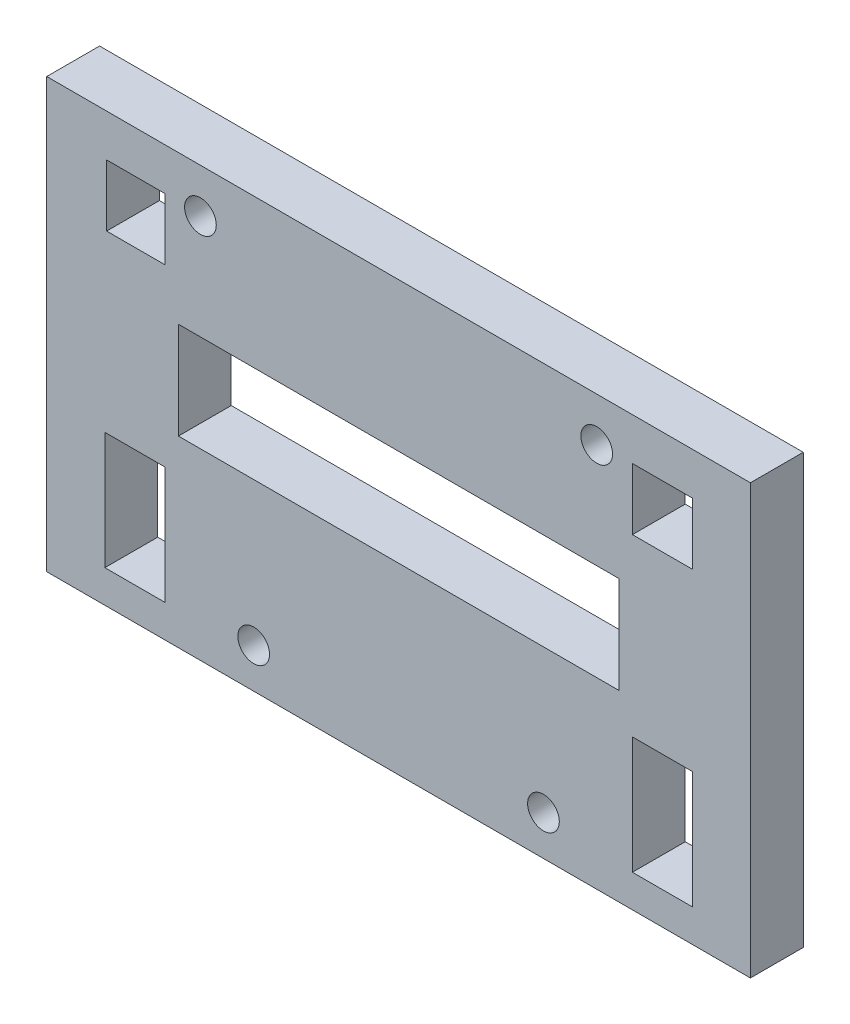
ISO-10303-21;
HEADER;
FILE_DESCRIPTION(('STEP AP214'),'2;1');
FILE_NAME('part.step','',(''),(''),'','','');
FILE_SCHEMA(('AUTOMOTIVE_DESIGN { 1 0 10303 214 1 1 1 1 }'));
ENDSEC;
DATA;
#1=APPLICATION_CONTEXT('core data for automotive mechanical design processes');
#2=APPLICATION_PROTOCOL_DEFINITION('international standard','automotive_design',2000,#1);
#3=PRODUCT_CONTEXT('',#1,'mechanical');
#4=PRODUCT('Part','Part','',(#3));
#5=PRODUCT_RELATED_PRODUCT_CATEGORY('part','',(#4));
#6=PRODUCT_DEFINITION_FORMATION('','',#4);
#7=PRODUCT_DEFINITION_CONTEXT('part definition',#1,'design');
#8=PRODUCT_DEFINITION('design','',#6,#7);
#9=PRODUCT_DEFINITION_SHAPE('','',#8);
#10=(LENGTH_UNIT() NAMED_UNIT(*) SI_UNIT(.MILLI.,.METRE.));
#11=(NAMED_UNIT(*) PLANE_ANGLE_UNIT() SI_UNIT($,.RADIAN.));
#12=(NAMED_UNIT(*) SI_UNIT($,.STERADIAN.) SOLID_ANGLE_UNIT());
#13=UNCERTAINTY_MEASURE_WITH_UNIT(LENGTH_MEASURE(1.E-05),#10,'distance_accuracy_value','');
#14=(GEOMETRIC_REPRESENTATION_CONTEXT(3) GLOBAL_UNCERTAINTY_ASSIGNED_CONTEXT((#13)) GLOBAL_UNIT_ASSIGNED_CONTEXT((#10,
#11,#12)) REPRESENTATION_CONTEXT('',''));
#15=CARTESIAN_POINT('',(0.,0.,0.));
#16=DIRECTION('',(0.,0.,1.));
#17=DIRECTION('',(1.,0.,0.));
#18=AXIS2_PLACEMENT_3D('',#15,#16,#17);
#19=CARTESIAN_POINT('',(0.,0.,6.));
#20=DIRECTION('',(0.,0.,1.));
#21=DIRECTION('',(1.,0.,0.));
#22=AXIS2_PLACEMENT_3D('',#19,#20,#21);
#23=PLANE('',#22);
#24=CARTESIAN_POINT('',(86.7166078075554,11.7571425144816,6.));
#25=DIRECTION('',(0.,0.,1.));
#26=DIRECTION('',(1.,0.,0.));
#27=AXIS2_PLACEMENT_3D('',#24,#25,#26);
#28=CIRCLE('',#27,1.8);
#29=CARTESIAN_POINT('',(88.5166078075554,11.7571425144816,6.));
#30=VERTEX_POINT('',#29);
#31=EDGE_CURVE('E365',#30,#30,#28,.T.);
#32=ORIENTED_EDGE('',*,*,#31,.F.);
#33=EDGE_LOOP('',(#32));
#34=FACE_BOUND('',#33,.T.);
#35=CARTESIAN_POINT('',(53.816607807554,11.7571425144822,6.));
#36=DIRECTION('',(0.,0.,1.));
#37=DIRECTION('',(1.,0.,0.));
#38=AXIS2_PLACEMENT_3D('',#35,#36,#37);
#39=CIRCLE('',#38,1.79999999999991);
#40=CARTESIAN_POINT('',(55.6166078075539,11.7571425144822,6.));
#41=VERTEX_POINT('',#40);
#42=EDGE_CURVE('E377',#41,#41,#39,.T.);
#43=ORIENTED_EDGE('',*,*,#42,.F.);
#44=EDGE_LOOP('',(#43));
#45=FACE_BOUND('',#44,.T.);
#46=DIRECTION('',(0.,-1.,0.));
#47=VECTOR('',#46,1.);
#48=CARTESIAN_POINT('',(30.3166078075552,55.9396789256046,6.));
#49=LINE('',#48,#47);
#50=CARTESIAN_POINT('',(30.3166078075552,55.9396789256046,6.));
#51=VERTEX_POINT('',#50);
#52=CARTESIAN_POINT('',(30.3166078075552,7.24140904448546,6.));
#53=VERTEX_POINT('',#52);
#54=EDGE_CURVE('E383',#51,#53,#49,.T.);
#55=ORIENTED_EDGE('',*,*,#54,.T.);
#56=DIRECTION('',(1.,0.,0.));
#57=VECTOR('',#56,1.);
#58=CARTESIAN_POINT('',(30.3166078075552,7.24140904448546,6.));
#59=LINE('',#58,#57);
#60=CARTESIAN_POINT('',(110.216607807554,7.24140904448489,6.));
#61=VERTEX_POINT('',#60);
#62=EDGE_CURVE('E386',#53,#61,#59,.T.);
#63=ORIENTED_EDGE('',*,*,#62,.T.);
#64=DIRECTION('',(0.,1.,0.));
#65=VECTOR('',#64,1.);
#66=CARTESIAN_POINT('',(110.216607807554,7.24140904448489,6.));
#67=LINE('',#66,#65);
#68=CARTESIAN_POINT('',(110.216607807555,55.9396789256044,6.));
#69=VERTEX_POINT('',#68);
#70=EDGE_CURVE('E389',#61,#69,#67,.T.);
#71=ORIENTED_EDGE('',*,*,#70,.T.);
#72=DIRECTION('',(-1.,0.,0.));
#73=VECTOR('',#72,1.);
#74=CARTESIAN_POINT('',(110.216607807555,55.9396789256044,6.));
#75=LINE('',#74,#73);
#76=EDGE_CURVE('E391',#69,#51,#75,.T.);
#77=ORIENTED_EDGE('',*,*,#76,.T.);
#78=EDGE_LOOP('',(#55,#63,#71,#77));
#79=FACE_BOUND('',#78,.T.);
#80=CARTESIAN_POINT('',(92.7666078075557,50.9396789256046,6.));
#81=DIRECTION('',(0.,0.,1.));
#82=DIRECTION('',(1.,0.,0.));
#83=AXIS2_PLACEMENT_3D('',#80,#81,#82);
#84=CIRCLE('',#83,1.8);
#85=CARTESIAN_POINT('',(94.5666078075557,50.9396789256046,6.));
#86=VERTEX_POINT('',#85);
#87=EDGE_CURVE('E371',#86,#86,#84,.T.);
#88=ORIENTED_EDGE('',*,*,#87,.F.);
#89=EDGE_LOOP('',(#88));
#90=FACE_BOUND('',#89,.T.);
#91=CARTESIAN_POINT('',(47.7666078075558,50.9396789256045,6.));
#92=DIRECTION('',(0.,0.,1.));
#93=DIRECTION('',(1.,0.,0.));
#94=AXIS2_PLACEMENT_3D('',#91,#92,#93);
#95=CIRCLE('',#94,1.8);
#96=CARTESIAN_POINT('',(49.5666078075558,50.9396789256045,6.));
#97=VERTEX_POINT('',#96);
#98=EDGE_CURVE('E359',#97,#97,#95,.T.);
#99=ORIENTED_EDGE('',*,*,#98,.F.);
#100=EDGE_LOOP('',(#99));
#101=FACE_BOUND('',#100,.T.);
#102=DIRECTION('',(-1.,0.,0.));
#103=VECTOR('',#102,1.);
#104=CARTESIAN_POINT('',(36.9166078075555,24.2519543495992,6.));
#105=LINE('',#104,#103);
#106=CARTESIAN_POINT('',(43.7166078075556,24.2519543495992,6.));
#107=VERTEX_POINT('',#106);
#108=CARTESIAN_POINT('',(36.9166078075555,24.2519543495992,6.));
#109=VERTEX_POINT('',#108);
#110=EDGE_CURVE('E330',#107,#109,#105,.T.);
#111=ORIENTED_EDGE('',*,*,#110,.F.);
#112=DIRECTION('',(0.,1.,0.));
#113=VECTOR('',#112,1.);
#114=CARTESIAN_POINT('',(43.7166078075556,24.2519543495992,6.));
#115=LINE('',#114,#113);
#116=CARTESIAN_POINT('',(43.7166078075556,10.939678925605,6.));
#117=VERTEX_POINT('',#116);
#118=EDGE_CURVE('E328',#117,#107,#115,.T.);
#119=ORIENTED_EDGE('',*,*,#118,.F.);
#120=DIRECTION('',(1.,0.,0.));
#121=VECTOR('',#120,1.);
#122=CARTESIAN_POINT('',(43.7166078075556,10.939678925605,6.));
#123=LINE('',#122,#121);
#124=CARTESIAN_POINT('',(36.9166078075554,10.9396789256052,6.));
#125=VERTEX_POINT('',#124);
#126=EDGE_CURVE('E336',#125,#117,#123,.T.);
#127=ORIENTED_EDGE('',*,*,#126,.F.);
#128=DIRECTION('',(0.,-1.,0.));
#129=VECTOR('',#128,1.);
#130=CARTESIAN_POINT('',(36.9166078075554,10.9396789256052,6.));
#131=LINE('',#130,#129);
#132=EDGE_CURVE('E333',#109,#125,#131,.T.);
#133=ORIENTED_EDGE('',*,*,#132,.F.);
#134=EDGE_LOOP('',(#111,#119,#127,#133));
#135=FACE_BOUND('',#134,.T.);
#136=DIRECTION('',(0.,1.,0.));
#137=VECTOR('',#136,1.);
#138=CARTESIAN_POINT('',(43.7166078075559,51.1396789256042,6.));
#139=LINE('',#138,#137);
#140=CARTESIAN_POINT('',(43.7166078075556,44.1396789256045,6.));
#141=VERTEX_POINT('',#140);
#142=CARTESIAN_POINT('',(43.7166078075559,51.1396789256042,6.));
#143=VERTEX_POINT('',#142);
#144=EDGE_CURVE('E299',#141,#143,#139,.T.);
#145=ORIENTED_EDGE('',*,*,#144,.F.);
#146=DIRECTION('',(1.,0.,0.));
#147=VECTOR('',#146,1.);
#148=CARTESIAN_POINT('',(43.7166078075556,44.1396789256045,6.));
#149=LINE('',#148,#147);
#150=CARTESIAN_POINT('',(37.116607807556,44.1396789256043,6.));
#151=VERTEX_POINT('',#150);
#152=EDGE_CURVE('E297',#151,#141,#149,.T.);
#153=ORIENTED_EDGE('',*,*,#152,.F.);
#154=DIRECTION('',(0.,-1.,0.));
#155=VECTOR('',#154,1.);
#156=CARTESIAN_POINT('',(37.116607807556,44.1396789256043,6.));
#157=LINE('',#156,#155);
#158=CARTESIAN_POINT('',(37.1166078075556,51.1396789256044,6.));
#159=VERTEX_POINT('',#158);
#160=EDGE_CURVE('E305',#159,#151,#157,.T.);
#161=ORIENTED_EDGE('',*,*,#160,.F.);
#162=DIRECTION('',(-1.,0.,0.));
#163=VECTOR('',#162,1.);
#164=CARTESIAN_POINT('',(37.1166078075556,51.1396789256044,6.));
#165=LINE('',#164,#163);
#166=EDGE_CURVE('E302',#143,#159,#165,.T.);
#167=ORIENTED_EDGE('',*,*,#166,.F.);
#168=EDGE_LOOP('',(#145,#153,#161,#167));
#169=FACE_BOUND('',#168,.T.);
#170=DIRECTION('',(1.,0.,0.));
#171=VECTOR('',#170,1.);
#172=CARTESIAN_POINT('',(96.8166078075556,10.9396789256048,6.));
#173=LINE('',#172,#171);
#174=CARTESIAN_POINT('',(96.8166078075556,10.9396789256048,6.));
#175=VERTEX_POINT('',#174);
#176=CARTESIAN_POINT('',(103.616607807555,10.939678925605,6.));
#177=VERTEX_POINT('',#176);
#178=EDGE_CURVE('E268',#175,#177,#173,.T.);
#179=ORIENTED_EDGE('',*,*,#178,.F.);
#180=DIRECTION('',(0.,-1.,0.));
#181=VECTOR('',#180,1.);
#182=CARTESIAN_POINT('',(96.8166078075552,24.2519543495986,6.));
#183=LINE('',#182,#181);
#184=CARTESIAN_POINT('',(96.8166078075552,24.2519543495986,6.));
#185=VERTEX_POINT('',#184);
#186=EDGE_CURVE('E266',#185,#175,#183,.T.);
#187=ORIENTED_EDGE('',*,*,#186,.F.);
#188=DIRECTION('',(-1.,0.,0.));
#189=VECTOR('',#188,1.);
#190=CARTESIAN_POINT('',(103.616607807555,24.2519543495984,6.));
#191=LINE('',#190,#189);
#192=CARTESIAN_POINT('',(103.616607807555,24.2519543495984,6.));
#193=VERTEX_POINT('',#192);
#194=EDGE_CURVE('E274',#193,#185,#191,.T.);
#195=ORIENTED_EDGE('',*,*,#194,.F.);
#196=DIRECTION('',(0.,1.,0.));
#197=VECTOR('',#196,1.);
#198=CARTESIAN_POINT('',(103.616607807555,10.939678925605,6.));
#199=LINE('',#198,#197);
#200=EDGE_CURVE('E271',#177,#193,#199,.T.);
#201=ORIENTED_EDGE('',*,*,#200,.F.);
#202=EDGE_LOOP('',(#179,#187,#195,#201));
#203=FACE_BOUND('',#202,.T.);
#204=DIRECTION('',(1.,0.,0.));
#205=VECTOR('',#204,1.);
#206=CARTESIAN_POINT('',(96.8166078075559,44.1396789256042,6.));
#207=LINE('',#206,#205);
#208=CARTESIAN_POINT('',(96.8166078075559,44.1396789256042,6.));
#209=VERTEX_POINT('',#208);
#210=CARTESIAN_POINT('',(103.616607807555,44.1396789256045,6.));
#211=VERTEX_POINT('',#210);
#212=EDGE_CURVE('E237',#209,#211,#207,.T.);
#213=ORIENTED_EDGE('',*,*,#212,.F.);
#214=DIRECTION('',(0.,-1.,0.));
#215=VECTOR('',#214,1.);
#216=CARTESIAN_POINT('',(96.8166078075559,51.1396789256043,6.));
#217=LINE('',#216,#215);
#218=CARTESIAN_POINT('',(96.8166078075559,51.1396789256043,6.));
#219=VERTEX_POINT('',#218);
#220=EDGE_CURVE('E235',#219,#209,#217,.T.);
#221=ORIENTED_EDGE('',*,*,#220,.F.);
#222=DIRECTION('',(-1.,0.,0.));
#223=VECTOR('',#222,1.);
#224=CARTESIAN_POINT('',(103.616607807555,51.1396789256045,6.));
#225=LINE('',#224,#223);
#226=CARTESIAN_POINT('',(103.616607807555,51.1396789256045,6.));
#227=VERTEX_POINT('',#226);
#228=EDGE_CURVE('E243',#227,#219,#225,.T.);
#229=ORIENTED_EDGE('',*,*,#228,.F.);
#230=DIRECTION('',(0.,1.,0.));
#231=VECTOR('',#230,1.);
#232=CARTESIAN_POINT('',(103.616607807555,44.1396789256045,6.));
#233=LINE('',#232,#231);
#234=EDGE_CURVE('E240',#211,#227,#233,.T.);
#235=ORIENTED_EDGE('',*,*,#234,.F.);
#236=EDGE_LOOP('',(#213,#221,#229,#235));
#237=FACE_BOUND('',#236,.T.);
#238=DIRECTION('',(0.,-1.,0.));
#239=VECTOR('',#238,1.);
#240=CARTESIAN_POINT('',(45.2666179586975,39.0571400164249,6.));
#241=LINE('',#240,#239);
#242=CARTESIAN_POINT('',(45.2666179586975,39.0571400164249,6.));
#243=VERTEX_POINT('',#242);
#244=CARTESIAN_POINT('',(45.266617958698,28.057145012539,6.));
#245=VERTEX_POINT('',#244);
#246=EDGE_CURVE('E207',#243,#245,#241,.T.);
#247=ORIENTED_EDGE('',*,*,#246,.F.);
#248=DIRECTION('',(-1.,0.,0.));
#249=VECTOR('',#248,1.);
#250=CARTESIAN_POINT('',(95.2665976564134,39.0571400164242,6.));
#251=LINE('',#250,#249);
#252=CARTESIAN_POINT('',(95.2665976564134,39.0571400164242,6.));
#253=VERTEX_POINT('',#252);
#254=EDGE_CURVE('E199',#253,#243,#251,.T.);
#255=ORIENTED_EDGE('',*,*,#254,.F.);
#256=DIRECTION('',(0.,1.,0.));
#257=VECTOR('',#256,1.);
#258=CARTESIAN_POINT('',(95.2665976564134,28.0571450125389,6.));
#259=LINE('',#258,#257);
#260=CARTESIAN_POINT('',(95.2665976564134,28.0571450125389,6.));
#261=VERTEX_POINT('',#260);
#262=EDGE_CURVE('E221',#261,#253,#259,.T.);
#263=ORIENTED_EDGE('',*,*,#262,.F.);
#264=DIRECTION('',(1.,0.,0.));
#265=VECTOR('',#264,1.);
#266=CARTESIAN_POINT('',(45.266617958698,28.057145012539,6.));
#267=LINE('',#266,#265);
#268=EDGE_CURVE('E219',#245,#261,#267,.T.);
#269=ORIENTED_EDGE('',*,*,#268,.F.);
#270=EDGE_LOOP('',(#247,#255,#263,#269));
#271=FACE_BOUND('',#270,.T.);
#272=ADVANCED_FACE('F38',(#34,#45,#79,#90,#101,#135,#169,#203,#237,#271),#23,.T.);
#273=CARTESIAN_POINT('',(0.,0.,0.));
#274=DIRECTION('',(0.,0.,1.));
#275=DIRECTION('',(1.,0.,0.));
#276=AXIS2_PLACEMENT_3D('',#273,#274,#275);
#277=PLANE('',#276);
#278=DIRECTION('',(0.,-1.,0.));
#279=VECTOR('',#278,1.);
#280=CARTESIAN_POINT('',(96.8166078075559,51.1396789256043,0.));
#281=LINE('',#280,#279);
#282=CARTESIAN_POINT('',(96.8166078075559,51.1396789256043,0.));
#283=VERTEX_POINT('',#282);
#284=CARTESIAN_POINT('',(96.8166078075559,44.1396789256042,0.));
#285=VERTEX_POINT('',#284);
#286=EDGE_CURVE('E215',#283,#285,#281,.T.);
#287=ORIENTED_EDGE('',*,*,#286,.T.);
#288=DIRECTION('',(1.,0.,0.));
#289=VECTOR('',#288,1.);
#290=CARTESIAN_POINT('',(96.8166078075559,44.1396789256042,0.));
#291=LINE('',#290,#289);
#292=CARTESIAN_POINT('',(103.616607807555,44.1396789256045,0.));
#293=VERTEX_POINT('',#292);
#294=EDGE_CURVE('E248',#285,#293,#291,.T.);
#295=ORIENTED_EDGE('',*,*,#294,.T.);
#296=DIRECTION('',(0.,1.,0.));
#297=VECTOR('',#296,1.);
#298=CARTESIAN_POINT('',(103.616607807555,44.1396789256045,0.));
#299=LINE('',#298,#297);
#300=CARTESIAN_POINT('',(103.616607807555,51.1396789256045,0.));
#301=VERTEX_POINT('',#300);
#302=EDGE_CURVE('E251',#293,#301,#299,.T.);
#303=ORIENTED_EDGE('',*,*,#302,.T.);
#304=DIRECTION('',(-1.,0.,0.));
#305=VECTOR('',#304,1.);
#306=CARTESIAN_POINT('',(103.616607807555,51.1396789256045,0.));
#307=LINE('',#306,#305);
#308=EDGE_CURVE('E238',#301,#283,#307,.T.);
#309=ORIENTED_EDGE('',*,*,#308,.T.);
#310=EDGE_LOOP('',(#287,#295,#303,#309));
#311=FACE_BOUND('',#310,.T.);
#312=DIRECTION('',(1.,0.,0.));
#313=VECTOR('',#312,1.);
#314=CARTESIAN_POINT('',(43.7166078075556,44.1396789256045,0.));
#315=LINE('',#314,#313);
#316=CARTESIAN_POINT('',(37.116607807556,44.1396789256043,0.));
#317=VERTEX_POINT('',#316);
#318=CARTESIAN_POINT('',(43.7166078075556,44.1396789256045,0.));
#319=VERTEX_POINT('',#318);
#320=EDGE_CURVE('E296',#317,#319,#315,.T.);
#321=ORIENTED_EDGE('',*,*,#320,.T.);
#322=DIRECTION('',(0.,1.,0.));
#323=VECTOR('',#322,1.);
#324=CARTESIAN_POINT('',(43.7166078075559,51.1396789256042,0.));
#325=LINE('',#324,#323);
#326=CARTESIAN_POINT('',(43.7166078075559,51.1396789256042,0.));
#327=VERTEX_POINT('',#326);
#328=EDGE_CURVE('E310',#319,#327,#325,.T.);
#329=ORIENTED_EDGE('',*,*,#328,.T.);
#330=DIRECTION('',(-1.,0.,0.));
#331=VECTOR('',#330,1.);
#332=CARTESIAN_POINT('',(37.1166078075556,51.1396789256044,0.));
#333=LINE('',#332,#331);
#334=CARTESIAN_POINT('',(37.1166078075556,51.1396789256044,0.));
#335=VERTEX_POINT('',#334);
#336=EDGE_CURVE('E313',#327,#335,#333,.T.);
#337=ORIENTED_EDGE('',*,*,#336,.T.);
#338=DIRECTION('',(0.,-1.,0.));
#339=VECTOR('',#338,1.);
#340=CARTESIAN_POINT('',(37.116607807556,44.1396789256043,0.));
#341=LINE('',#340,#339);
#342=EDGE_CURVE('E300',#335,#317,#341,.T.);
#343=ORIENTED_EDGE('',*,*,#342,.T.);
#344=EDGE_LOOP('',(#321,#329,#337,#343));
#345=FACE_BOUND('',#344,.T.);
#346=CARTESIAN_POINT('',(47.7666078075558,50.9396789256045,0.));
#347=DIRECTION('',(0.,0.,1.));
#348=DIRECTION('',(1.,0.,0.));
#349=AXIS2_PLACEMENT_3D('',#346,#347,#348);
#350=CIRCLE('',#349,1.8);
#351=CARTESIAN_POINT('',(49.5666078075558,50.9396789256045,0.));
#352=VERTEX_POINT('',#351);
#353=EDGE_CURVE('E358',#352,#352,#350,.T.);
#354=ORIENTED_EDGE('',*,*,#353,.T.);
#355=EDGE_LOOP('',(#354));
#356=FACE_BOUND('',#355,.T.);
#357=CARTESIAN_POINT('',(86.7166078075554,11.7571425144816,0.));
#358=DIRECTION('',(0.,0.,1.));
#359=DIRECTION('',(1.,0.,0.));
#360=AXIS2_PLACEMENT_3D('',#357,#358,#359);
#361=CIRCLE('',#360,1.8);
#362=CARTESIAN_POINT('',(88.5166078075554,11.7571425144816,0.));
#363=VERTEX_POINT('',#362);
#364=EDGE_CURVE('E362',#363,#363,#361,.T.);
#365=ORIENTED_EDGE('',*,*,#364,.T.);
#366=EDGE_LOOP('',(#365));
#367=FACE_BOUND('',#366,.T.);
#368=CARTESIAN_POINT('',(92.7666078075557,50.9396789256046,0.));
#369=DIRECTION('',(0.,0.,1.));
#370=DIRECTION('',(1.,0.,0.));
#371=AXIS2_PLACEMENT_3D('',#368,#369,#370);
#372=CIRCLE('',#371,1.8);
#373=CARTESIAN_POINT('',(94.5666078075557,50.9396789256046,0.));
#374=VERTEX_POINT('',#373);
#375=EDGE_CURVE('E368',#374,#374,#372,.T.);
#376=ORIENTED_EDGE('',*,*,#375,.T.);
#377=EDGE_LOOP('',(#376));
#378=FACE_BOUND('',#377,.T.);
#379=CARTESIAN_POINT('',(53.816607807554,11.7571425144822,0.));
#380=DIRECTION('',(0.,0.,1.));
#381=DIRECTION('',(1.,0.,0.));
#382=AXIS2_PLACEMENT_3D('',#379,#380,#381);
#383=CIRCLE('',#382,1.79999999999991);
#384=CARTESIAN_POINT('',(55.6166078075539,11.7571425144822,0.));
#385=VERTEX_POINT('',#384);
#386=EDGE_CURVE('E374',#385,#385,#383,.T.);
#387=ORIENTED_EDGE('',*,*,#386,.T.);
#388=EDGE_LOOP('',(#387));
#389=FACE_BOUND('',#388,.T.);
#390=DIRECTION('',(0.,-1.,0.));
#391=VECTOR('',#390,1.);
#392=CARTESIAN_POINT('',(30.3166078075552,55.9396789256046,0.));
#393=LINE('',#392,#391);
#394=CARTESIAN_POINT('',(30.3166078075552,55.9396789256046,0.));
#395=VERTEX_POINT('',#394);
#396=CARTESIAN_POINT('',(30.3166078075552,7.24140904448546,0.));
#397=VERTEX_POINT('',#396);
#398=EDGE_CURVE('E380',#395,#397,#393,.T.);
#399=ORIENTED_EDGE('',*,*,#398,.F.);
#400=DIRECTION('',(-1.,0.,0.));
#401=VECTOR('',#400,1.);
#402=CARTESIAN_POINT('',(110.216607807555,55.9396789256044,0.));
#403=LINE('',#402,#401);
#404=CARTESIAN_POINT('',(110.216607807555,55.9396789256044,0.));
#405=VERTEX_POINT('',#404);
#406=EDGE_CURVE('E387',#405,#395,#403,.T.);
#407=ORIENTED_EDGE('',*,*,#406,.F.);
#408=DIRECTION('',(0.,1.,0.));
#409=VECTOR('',#408,1.);
#410=CARTESIAN_POINT('',(110.216607807554,7.24140904448489,0.));
#411=LINE('',#410,#409);
#412=CARTESIAN_POINT('',(110.216607807554,7.24140904448489,0.));
#413=VERTEX_POINT('',#412);
#414=EDGE_CURVE('E398',#413,#405,#411,.T.);
#415=ORIENTED_EDGE('',*,*,#414,.F.);
#416=DIRECTION('',(1.,0.,0.));
#417=VECTOR('',#416,1.);
#418=CARTESIAN_POINT('',(30.3166078075552,7.24140904448546,0.));
#419=LINE('',#418,#417);
#420=EDGE_CURVE('E396',#397,#413,#419,.T.);
#421=ORIENTED_EDGE('',*,*,#420,.F.);
#422=EDGE_LOOP('',(#399,#407,#415,#421));
#423=FACE_BOUND('',#422,.T.);
#424=DIRECTION('',(0.,1.,0.));
#425=VECTOR('',#424,1.);
#426=CARTESIAN_POINT('',(43.7166078075556,24.2519543495992,0.));
#427=LINE('',#426,#425);
#428=CARTESIAN_POINT('',(43.7166078075556,10.939678925605,0.));
#429=VERTEX_POINT('',#428);
#430=CARTESIAN_POINT('',(43.7166078075556,24.2519543495992,0.));
#431=VERTEX_POINT('',#430);
#432=EDGE_CURVE('E327',#429,#431,#427,.T.);
#433=ORIENTED_EDGE('',*,*,#432,.T.);
#434=DIRECTION('',(-1.,0.,0.));
#435=VECTOR('',#434,1.);
#436=CARTESIAN_POINT('',(36.9166078075555,24.2519543495992,0.));
#437=LINE('',#436,#435);
#438=CARTESIAN_POINT('',(36.9166078075555,24.2519543495992,0.));
#439=VERTEX_POINT('',#438);
#440=EDGE_CURVE('E341',#431,#439,#437,.T.);
#441=ORIENTED_EDGE('',*,*,#440,.T.);
#442=DIRECTION('',(0.,-1.,0.));
#443=VECTOR('',#442,1.);
#444=CARTESIAN_POINT('',(36.9166078075554,10.9396789256052,0.));
#445=LINE('',#444,#443);
#446=CARTESIAN_POINT('',(36.9166078075554,10.9396789256052,0.));
#447=VERTEX_POINT('',#446);
#448=EDGE_CURVE('E344',#439,#447,#445,.T.);
#449=ORIENTED_EDGE('',*,*,#448,.T.);
#450=DIRECTION('',(1.,0.,0.));
#451=VECTOR('',#450,1.);
#452=CARTESIAN_POINT('',(43.7166078075556,10.939678925605,0.));
#453=LINE('',#452,#451);
#454=EDGE_CURVE('E331',#447,#429,#453,.T.);
#455=ORIENTED_EDGE('',*,*,#454,.T.);
#456=EDGE_LOOP('',(#433,#441,#449,#455));
#457=FACE_BOUND('',#456,.T.);
#458=DIRECTION('',(0.,-1.,0.));
#459=VECTOR('',#458,1.);
#460=CARTESIAN_POINT('',(96.8166078075552,24.2519543495986,0.));
#461=LINE('',#460,#459);
#462=CARTESIAN_POINT('',(96.8166078075552,24.2519543495986,0.));
#463=VERTEX_POINT('',#462);
#464=CARTESIAN_POINT('',(96.8166078075556,10.9396789256048,0.));
#465=VERTEX_POINT('',#464);
#466=EDGE_CURVE('E265',#463,#465,#461,.T.);
#467=ORIENTED_EDGE('',*,*,#466,.T.);
#468=DIRECTION('',(1.,0.,0.));
#469=VECTOR('',#468,1.);
#470=CARTESIAN_POINT('',(96.8166078075556,10.9396789256048,0.));
#471=LINE('',#470,#469);
#472=CARTESIAN_POINT('',(103.616607807555,10.939678925605,0.));
#473=VERTEX_POINT('',#472);
#474=EDGE_CURVE('E279',#465,#473,#471,.T.);
#475=ORIENTED_EDGE('',*,*,#474,.T.);
#476=DIRECTION('',(0.,1.,0.));
#477=VECTOR('',#476,1.);
#478=CARTESIAN_POINT('',(103.616607807555,10.939678925605,0.));
#479=LINE('',#478,#477);
#480=CARTESIAN_POINT('',(103.616607807555,24.2519543495984,0.));
#481=VERTEX_POINT('',#480);
#482=EDGE_CURVE('E282',#473,#481,#479,.T.);
#483=ORIENTED_EDGE('',*,*,#482,.T.);
#484=DIRECTION('',(-1.,0.,0.));
#485=VECTOR('',#484,1.);
#486=CARTESIAN_POINT('',(103.616607807555,24.2519543495984,0.));
#487=LINE('',#486,#485);
#488=EDGE_CURVE('E269',#481,#463,#487,.T.);
#489=ORIENTED_EDGE('',*,*,#488,.T.);
#490=EDGE_LOOP('',(#467,#475,#483,#489));
#491=FACE_BOUND('',#490,.T.);
#492=DIRECTION('',(-1.,0.,0.));
#493=VECTOR('',#492,1.);
#494=CARTESIAN_POINT('',(95.2665976564134,39.0571400164242,0.));
#495=LINE('',#494,#493);
#496=CARTESIAN_POINT('',(95.2665976564134,39.0571400164242,0.));
#497=VERTEX_POINT('',#496);
#498=CARTESIAN_POINT('',(45.2666179586975,39.0571400164249,0.));
#499=VERTEX_POINT('',#498);
#500=EDGE_CURVE('E61',#497,#499,#495,.T.);
#501=ORIENTED_EDGE('',*,*,#500,.T.);
#502=DIRECTION('',(0.,-1.,0.));
#503=VECTOR('',#502,1.);
#504=CARTESIAN_POINT('',(45.2666179586975,39.0571400164249,0.));
#505=LINE('',#504,#503);
#506=CARTESIAN_POINT('',(45.266617958698,28.057145012539,0.));
#507=VERTEX_POINT('',#506);
#508=EDGE_CURVE('E214',#499,#507,#505,.T.);
#509=ORIENTED_EDGE('',*,*,#508,.T.);
#510=DIRECTION('',(1.,0.,0.));
#511=VECTOR('',#510,1.);
#512=CARTESIAN_POINT('',(45.266617958698,28.057145012539,0.));
#513=LINE('',#512,#511);
#514=CARTESIAN_POINT('',(95.2665976564134,28.0571450125389,0.));
#515=VERTEX_POINT('',#514);
#516=EDGE_CURVE('E227',#507,#515,#513,.T.);
#517=ORIENTED_EDGE('',*,*,#516,.T.);
#518=DIRECTION('',(0.,1.,0.));
#519=VECTOR('',#518,1.);
#520=CARTESIAN_POINT('',(95.2665976564134,28.0571450125389,0.));
#521=LINE('',#520,#519);
#522=EDGE_CURVE('E208',#515,#497,#521,.T.);
#523=ORIENTED_EDGE('',*,*,#522,.T.);
#524=EDGE_LOOP('',(#501,#509,#517,#523));
#525=FACE_BOUND('',#524,.T.);
#526=ADVANCED_FACE('F416',(#311,#345,#356,#367,#378,#389,#423,#457,#491,#525),#277,.F.);
#527=CARTESIAN_POINT('',(30.3166078075552,55.9396789256046,6.));
#528=DIRECTION('',(1.,0.,0.));
#529=DIRECTION('',(0.,0.,-1.));
#530=AXIS2_PLACEMENT_3D('',#527,#528,#529);
#531=PLANE('',#530);
#532=ORIENTED_EDGE('',*,*,#398,.T.);
#533=DIRECTION('',(0.,0.,-1.));
#534=VECTOR('',#533,1.);
#535=CARTESIAN_POINT('',(30.3166078075552,7.24140904448546,6.));
#536=LINE('',#535,#534);
#537=EDGE_CURVE('E11',#53,#397,#536,.T.);
#538=ORIENTED_EDGE('',*,*,#537,.F.);
#539=ORIENTED_EDGE('',*,*,#54,.F.);
#540=DIRECTION('',(0.,0.,-1.));
#541=VECTOR('',#540,1.);
#542=CARTESIAN_POINT('',(30.3166078075552,55.9396789256046,6.));
#543=LINE('',#542,#541);
#544=EDGE_CURVE('E393',#51,#395,#543,.T.);
#545=ORIENTED_EDGE('',*,*,#544,.T.);
#546=EDGE_LOOP('',(#532,#538,#539,#545));
#547=FACE_BOUND('',#546,.T.);
#548=ADVANCED_FACE('F40',(#547),#531,.F.);
#549=CARTESIAN_POINT('',(30.3166078075552,7.24140904448546,6.));
#550=DIRECTION('',(0.,1.,0.));
#551=DIRECTION('',(-1.,0.,0.));
#552=AXIS2_PLACEMENT_3D('',#549,#550,#551);
#553=PLANE('',#552);
#554=ORIENTED_EDGE('',*,*,#420,.T.);
#555=DIRECTION('',(0.,0.,-1.));
#556=VECTOR('',#555,1.);
#557=CARTESIAN_POINT('',(110.216607807554,7.24140904448489,6.));
#558=LINE('',#557,#556);
#559=EDGE_CURVE('E46',#61,#413,#558,.T.);
#560=ORIENTED_EDGE('',*,*,#559,.F.);
#561=ORIENTED_EDGE('',*,*,#62,.F.);
#562=ORIENTED_EDGE('',*,*,#537,.T.);
#563=EDGE_LOOP('',(#554,#560,#561,#562));
#564=FACE_BOUND('',#563,.T.);
#565=ADVANCED_FACE('F427',(#564),#553,.F.);
#566=CARTESIAN_POINT('',(110.216607807554,7.24140904448489,6.));
#567=DIRECTION('',(-1.,0.,0.));
#568=DIRECTION('',(0.,-1.,0.));
#569=AXIS2_PLACEMENT_3D('',#566,#567,#568);
#570=PLANE('',#569);
#571=ORIENTED_EDGE('',*,*,#414,.T.);
#572=DIRECTION('',(0.,0.,-1.));
#573=VECTOR('',#572,1.);
#574=CARTESIAN_POINT('',(110.216607807555,55.9396789256044,6.));
#575=LINE('',#574,#573);
#576=EDGE_CURVE('E403',#69,#405,#575,.T.);
#577=ORIENTED_EDGE('',*,*,#576,.F.);
#578=ORIENTED_EDGE('',*,*,#70,.F.);
#579=ORIENTED_EDGE('',*,*,#559,.T.);
#580=EDGE_LOOP('',(#571,#577,#578,#579));
#581=FACE_BOUND('',#580,.T.);
#582=ADVANCED_FACE('F410',(#581),#570,.F.);
#583=CARTESIAN_POINT('',(110.216607807555,55.9396789256044,6.));
#584=DIRECTION('',(0.,-1.,0.));
#585=DIRECTION('',(1.,0.,0.));
#586=AXIS2_PLACEMENT_3D('',#583,#584,#585);
#587=PLANE('',#586);
#588=ORIENTED_EDGE('',*,*,#406,.T.);
#589=ORIENTED_EDGE('',*,*,#544,.F.);
#590=ORIENTED_EDGE('',*,*,#76,.F.);
#591=ORIENTED_EDGE('',*,*,#576,.T.);
#592=EDGE_LOOP('',(#588,#589,#590,#591));
#593=FACE_BOUND('',#592,.T.);
#594=ADVANCED_FACE('F420',(#593),#587,.F.);
#595=CARTESIAN_POINT('',(53.816607807554,11.7571425144822,6.));
#596=DIRECTION('',(0.,0.,-1.));
#597=DIRECTION('',(-1.,0.,0.));
#598=AXIS2_PLACEMENT_3D('',#595,#596,#597);
#599=CYLINDRICAL_SURFACE('',#598,1.79999999999991);
#600=ORIENTED_EDGE('',*,*,#42,.T.);
#601=EDGE_LOOP('',(#600));
#602=FACE_BOUND('',#601,.T.);
#603=ORIENTED_EDGE('',*,*,#386,.F.);
#604=EDGE_LOOP('',(#603));
#605=FACE_BOUND('',#604,.T.);
#606=ADVANCED_FACE('F444',(#602,#605),#599,.F.);
#607=CARTESIAN_POINT('',(92.7666078075557,50.9396789256046,6.));
#608=DIRECTION('',(0.,0.,-1.));
#609=DIRECTION('',(-1.,0.,0.));
#610=AXIS2_PLACEMENT_3D('',#607,#608,#609);
#611=CYLINDRICAL_SURFACE('',#610,1.8);
#612=ORIENTED_EDGE('',*,*,#87,.T.);
#613=EDGE_LOOP('',(#612));
#614=FACE_BOUND('',#613,.T.);
#615=ORIENTED_EDGE('',*,*,#375,.F.);
#616=EDGE_LOOP('',(#615));
#617=FACE_BOUND('',#616,.T.);
#618=ADVANCED_FACE('F451',(#614,#617),#611,.F.);
#619=CARTESIAN_POINT('',(86.7166078075554,11.7571425144816,6.));
#620=DIRECTION('',(0.,0.,-1.));
#621=DIRECTION('',(-1.,0.,0.));
#622=AXIS2_PLACEMENT_3D('',#619,#620,#621);
#623=CYLINDRICAL_SURFACE('',#622,1.8);
#624=ORIENTED_EDGE('',*,*,#31,.T.);
#625=EDGE_LOOP('',(#624));
#626=FACE_BOUND('',#625,.T.);
#627=ORIENTED_EDGE('',*,*,#364,.F.);
#628=EDGE_LOOP('',(#627));
#629=FACE_BOUND('',#628,.T.);
#630=ADVANCED_FACE('F456',(#626,#629),#623,.F.);
#631=CARTESIAN_POINT('',(47.7666078075558,50.9396789256045,6.));
#632=DIRECTION('',(0.,0.,-1.));
#633=DIRECTION('',(-1.,0.,0.));
#634=AXIS2_PLACEMENT_3D('',#631,#632,#633);
#635=CYLINDRICAL_SURFACE('',#634,1.8);
#636=ORIENTED_EDGE('',*,*,#98,.T.);
#637=EDGE_LOOP('',(#636));
#638=FACE_BOUND('',#637,.T.);
#639=ORIENTED_EDGE('',*,*,#353,.F.);
#640=EDGE_LOOP('',(#639));
#641=FACE_BOUND('',#640,.T.);
#642=ADVANCED_FACE('F465',(#638,#641),#635,.F.);
#643=CARTESIAN_POINT('',(43.7166078075556,24.2519543495992,6.));
#644=DIRECTION('',(-1.,0.,0.));
#645=DIRECTION('',(0.,0.,1.));
#646=AXIS2_PLACEMENT_3D('',#643,#644,#645);
#647=PLANE('',#646);
#648=ORIENTED_EDGE('',*,*,#432,.F.);
#649=DIRECTION('',(0.,0.,-1.));
#650=VECTOR('',#649,1.);
#651=CARTESIAN_POINT('',(43.7166078075556,10.939678925605,6.));
#652=LINE('',#651,#650);
#653=EDGE_CURVE('E338',#117,#429,#652,.T.);
#654=ORIENTED_EDGE('',*,*,#653,.F.);
#655=ORIENTED_EDGE('',*,*,#118,.T.);
#656=DIRECTION('',(0.,0.,-1.));
#657=VECTOR('',#656,1.);
#658=CARTESIAN_POINT('',(43.7166078075556,24.2519543495992,6.));
#659=LINE('',#658,#657);
#660=EDGE_CURVE('E355',#107,#431,#659,.T.);
#661=ORIENTED_EDGE('',*,*,#660,.T.);
#662=EDGE_LOOP('',(#648,#654,#655,#661));
#663=FACE_BOUND('',#662,.T.);
#664=ADVANCED_FACE('F472',(#663),#647,.T.);
#665=CARTESIAN_POINT('',(36.9166078075555,24.2519543495992,6.));
#666=DIRECTION('',(0.,-1.,0.));
#667=DIRECTION('',(0.,0.,-1.));
#668=AXIS2_PLACEMENT_3D('',#665,#666,#667);
#669=PLANE('',#668);
#670=ORIENTED_EDGE('',*,*,#440,.F.);
#671=ORIENTED_EDGE('',*,*,#660,.F.);
#672=ORIENTED_EDGE('',*,*,#110,.T.);
#673=DIRECTION('',(0.,0.,-1.));
#674=VECTOR('',#673,1.);
#675=CARTESIAN_POINT('',(36.9166078075555,24.2519543495992,6.));
#676=LINE('',#675,#674);
#677=EDGE_CURVE('E353',#109,#439,#676,.T.);
#678=ORIENTED_EDGE('',*,*,#677,.T.);
#679=EDGE_LOOP('',(#670,#671,#672,#678));
#680=FACE_BOUND('',#679,.T.);
#681=ADVANCED_FACE('F476',(#680),#669,.T.);
#682=CARTESIAN_POINT('',(36.9166078075554,10.9396789256052,6.));
#683=DIRECTION('',(1.,0.,0.));
#684=DIRECTION('',(0.,1.,0.));
#685=AXIS2_PLACEMENT_3D('',#682,#683,#684);
#686=PLANE('',#685);
#687=ORIENTED_EDGE('',*,*,#448,.F.);
#688=ORIENTED_EDGE('',*,*,#677,.F.);
#689=ORIENTED_EDGE('',*,*,#132,.T.);
#690=DIRECTION('',(0.,0.,-1.));
#691=VECTOR('',#690,1.);
#692=CARTESIAN_POINT('',(36.9166078075554,10.9396789256052,6.));
#693=LINE('',#692,#691);
#694=EDGE_CURVE('E351',#125,#447,#693,.T.);
#695=ORIENTED_EDGE('',*,*,#694,.T.);
#696=EDGE_LOOP('',(#687,#688,#689,#695));
#697=FACE_BOUND('',#696,.T.);
#698=ADVANCED_FACE('F480',(#697),#686,.T.);
#699=CARTESIAN_POINT('',(43.7166078075556,10.939678925605,6.));
#700=DIRECTION('',(0.,1.,0.));
#701=DIRECTION('',(-1.,0.,0.));
#702=AXIS2_PLACEMENT_3D('',#699,#700,#701);
#703=PLANE('',#702);
#704=ORIENTED_EDGE('',*,*,#454,.F.);
#705=ORIENTED_EDGE('',*,*,#694,.F.);
#706=ORIENTED_EDGE('',*,*,#126,.T.);
#707=ORIENTED_EDGE('',*,*,#653,.T.);
#708=EDGE_LOOP('',(#704,#705,#706,#707));
#709=FACE_BOUND('',#708,.T.);
#710=ADVANCED_FACE('F484',(#709),#703,.T.);
#711=CARTESIAN_POINT('',(43.7166078075556,44.1396789256045,6.));
#712=DIRECTION('',(0.,1.,0.));
#713=DIRECTION('',(-1.,0.,0.));
#714=AXIS2_PLACEMENT_3D('',#711,#712,#713);
#715=PLANE('',#714);
#716=ORIENTED_EDGE('',*,*,#320,.F.);
#717=DIRECTION('',(0.,0.,-1.));
#718=VECTOR('',#717,1.);
#719=CARTESIAN_POINT('',(37.116607807556,44.1396789256043,6.));
#720=LINE('',#719,#718);
#721=EDGE_CURVE('E307',#151,#317,#720,.T.);
#722=ORIENTED_EDGE('',*,*,#721,.F.);
#723=ORIENTED_EDGE('',*,*,#152,.T.);
#724=DIRECTION('',(0.,0.,-1.));
#725=VECTOR('',#724,1.);
#726=CARTESIAN_POINT('',(43.7166078075556,44.1396789256045,6.));
#727=LINE('',#726,#725);
#728=EDGE_CURVE('E324',#141,#319,#727,.T.);
#729=ORIENTED_EDGE('',*,*,#728,.T.);
#730=EDGE_LOOP('',(#716,#722,#723,#729));
#731=FACE_BOUND('',#730,.T.);
#732=ADVANCED_FACE('F488',(#731),#715,.T.);
#733=CARTESIAN_POINT('',(43.7166078075559,51.1396789256042,6.));
#734=DIRECTION('',(-1.,0.,0.));
#735=DIRECTION('',(0.,-1.,0.));
#736=AXIS2_PLACEMENT_3D('',#733,#734,#735);
#737=PLANE('',#736);
#738=ORIENTED_EDGE('',*,*,#328,.F.);
#739=ORIENTED_EDGE('',*,*,#728,.F.);
#740=ORIENTED_EDGE('',*,*,#144,.T.);
#741=DIRECTION('',(0.,0.,-1.));
#742=VECTOR('',#741,1.);
#743=CARTESIAN_POINT('',(43.7166078075559,51.1396789256042,6.));
#744=LINE('',#743,#742);
#745=EDGE_CURVE('E322',#143,#327,#744,.T.);
#746=ORIENTED_EDGE('',*,*,#745,.T.);
#747=EDGE_LOOP('',(#738,#739,#740,#746));
#748=FACE_BOUND('',#747,.T.);
#749=ADVANCED_FACE('F492',(#748),#737,.T.);
#750=CARTESIAN_POINT('',(37.1166078075556,51.1396789256044,6.));
#751=DIRECTION('',(0.,-1.,0.));
#752=DIRECTION('',(1.,0.,0.));
#753=AXIS2_PLACEMENT_3D('',#750,#751,#752);
#754=PLANE('',#753);
#755=ORIENTED_EDGE('',*,*,#336,.F.);
#756=ORIENTED_EDGE('',*,*,#745,.F.);
#757=ORIENTED_EDGE('',*,*,#166,.T.);
#758=DIRECTION('',(0.,0.,-1.));
#759=VECTOR('',#758,1.);
#760=CARTESIAN_POINT('',(37.1166078075556,51.1396789256044,6.));
#761=LINE('',#760,#759);
#762=EDGE_CURVE('E320',#159,#335,#761,.T.);
#763=ORIENTED_EDGE('',*,*,#762,.T.);
#764=EDGE_LOOP('',(#755,#756,#757,#763));
#765=FACE_BOUND('',#764,.T.);
#766=ADVANCED_FACE('F496',(#765),#754,.T.);
#767=CARTESIAN_POINT('',(37.116607807556,44.1396789256043,6.));
#768=DIRECTION('',(1.,0.,0.));
#769=DIRECTION('',(0.,1.,0.));
#770=AXIS2_PLACEMENT_3D('',#767,#768,#769);
#771=PLANE('',#770);
#772=ORIENTED_EDGE('',*,*,#342,.F.);
#773=ORIENTED_EDGE('',*,*,#762,.F.);
#774=ORIENTED_EDGE('',*,*,#160,.T.);
#775=ORIENTED_EDGE('',*,*,#721,.T.);
#776=EDGE_LOOP('',(#772,#773,#774,#775));
#777=FACE_BOUND('',#776,.T.);
#778=ADVANCED_FACE('F500',(#777),#771,.T.);
#779=CARTESIAN_POINT('',(96.8166078075552,24.2519543495986,6.));
#780=DIRECTION('',(1.,0.,0.));
#781=DIRECTION('',(0.,1.,0.));
#782=AXIS2_PLACEMENT_3D('',#779,#780,#781);
#783=PLANE('',#782);
#784=ORIENTED_EDGE('',*,*,#466,.F.);
#785=DIRECTION('',(0.,0.,-1.));
#786=VECTOR('',#785,1.);
#787=CARTESIAN_POINT('',(96.8166078075552,24.2519543495986,6.));
#788=LINE('',#787,#786);
#789=EDGE_CURVE('E276',#185,#463,#788,.T.);
#790=ORIENTED_EDGE('',*,*,#789,.F.);
#791=ORIENTED_EDGE('',*,*,#186,.T.);
#792=DIRECTION('',(0.,0.,-1.));
#793=VECTOR('',#792,1.);
#794=CARTESIAN_POINT('',(96.8166078075556,10.9396789256048,6.));
#795=LINE('',#794,#793);
#796=EDGE_CURVE('E293',#175,#465,#795,.T.);
#797=ORIENTED_EDGE('',*,*,#796,.T.);
#798=EDGE_LOOP('',(#784,#790,#791,#797));
#799=FACE_BOUND('',#798,.T.);
#800=ADVANCED_FACE('F504',(#799),#783,.T.);
#801=CARTESIAN_POINT('',(96.8166078075556,10.9396789256048,6.));
#802=DIRECTION('',(0.,1.,0.));
#803=DIRECTION('',(-1.,0.,0.));
#804=AXIS2_PLACEMENT_3D('',#801,#802,#803);
#805=PLANE('',#804);
#806=ORIENTED_EDGE('',*,*,#474,.F.);
#807=ORIENTED_EDGE('',*,*,#796,.F.);
#808=ORIENTED_EDGE('',*,*,#178,.T.);
#809=DIRECTION('',(0.,0.,-1.));
#810=VECTOR('',#809,1.);
#811=CARTESIAN_POINT('',(103.616607807555,10.939678925605,6.));
#812=LINE('',#811,#810);
#813=EDGE_CURVE('E291',#177,#473,#812,.T.);
#814=ORIENTED_EDGE('',*,*,#813,.T.);
#815=EDGE_LOOP('',(#806,#807,#808,#814));
#816=FACE_BOUND('',#815,.T.);
#817=ADVANCED_FACE('F508',(#816),#805,.T.);
#818=CARTESIAN_POINT('',(103.616607807555,10.939678925605,6.));
#819=DIRECTION('',(-1.,0.,0.));
#820=DIRECTION('',(0.,-1.,0.));
#821=AXIS2_PLACEMENT_3D('',#818,#819,#820);
#822=PLANE('',#821);
#823=ORIENTED_EDGE('',*,*,#482,.F.);
#824=ORIENTED_EDGE('',*,*,#813,.F.);
#825=ORIENTED_EDGE('',*,*,#200,.T.);
#826=DIRECTION('',(0.,0.,-1.));
#827=VECTOR('',#826,1.);
#828=CARTESIAN_POINT('',(103.616607807555,24.2519543495984,6.));
#829=LINE('',#828,#827);
#830=EDGE_CURVE('E289',#193,#481,#829,.T.);
#831=ORIENTED_EDGE('',*,*,#830,.T.);
#832=EDGE_LOOP('',(#823,#824,#825,#831));
#833=FACE_BOUND('',#832,.T.);
#834=ADVANCED_FACE('F512',(#833),#822,.T.);
#835=CARTESIAN_POINT('',(103.616607807555,24.2519543495984,6.));
#836=DIRECTION('',(0.,-1.,0.));
#837=DIRECTION('',(1.,0.,0.));
#838=AXIS2_PLACEMENT_3D('',#835,#836,#837);
#839=PLANE('',#838);
#840=ORIENTED_EDGE('',*,*,#488,.F.);
#841=ORIENTED_EDGE('',*,*,#830,.F.);
#842=ORIENTED_EDGE('',*,*,#194,.T.);
#843=ORIENTED_EDGE('',*,*,#789,.T.);
#844=EDGE_LOOP('',(#840,#841,#842,#843));
#845=FACE_BOUND('',#844,.T.);
#846=ADVANCED_FACE('F516',(#845),#839,.T.);
#847=CARTESIAN_POINT('',(96.8166078075559,51.1396789256043,6.));
#848=DIRECTION('',(1.,0.,0.));
#849=DIRECTION('',(0.,0.,-1.));
#850=AXIS2_PLACEMENT_3D('',#847,#848,#849);
#851=PLANE('',#850);
#852=ORIENTED_EDGE('',*,*,#286,.F.);
#853=DIRECTION('',(0.,0.,-1.));
#854=VECTOR('',#853,1.);
#855=CARTESIAN_POINT('',(96.8166078075559,51.1396789256043,6.));
#856=LINE('',#855,#854);
#857=EDGE_CURVE('E245',#219,#283,#856,.T.);
#858=ORIENTED_EDGE('',*,*,#857,.F.);
#859=ORIENTED_EDGE('',*,*,#220,.T.);
#860=DIRECTION('',(0.,0.,-1.));
#861=VECTOR('',#860,1.);
#862=CARTESIAN_POINT('',(96.8166078075559,44.1396789256042,6.));
#863=LINE('',#862,#861);
#864=EDGE_CURVE('E262',#209,#285,#863,.T.);
#865=ORIENTED_EDGE('',*,*,#864,.T.);
#866=EDGE_LOOP('',(#852,#858,#859,#865));
#867=FACE_BOUND('',#866,.T.);
#868=ADVANCED_FACE('F520',(#867),#851,.T.);
#869=CARTESIAN_POINT('',(96.8166078075559,44.1396789256042,6.));
#870=DIRECTION('',(0.,1.,0.));
#871=DIRECTION('',(-1.,0.,0.));
#872=AXIS2_PLACEMENT_3D('',#869,#870,#871);
#873=PLANE('',#872);
#874=ORIENTED_EDGE('',*,*,#294,.F.);
#875=ORIENTED_EDGE('',*,*,#864,.F.);
#876=ORIENTED_EDGE('',*,*,#212,.T.);
#877=DIRECTION('',(0.,0.,-1.));
#878=VECTOR('',#877,1.);
#879=CARTESIAN_POINT('',(103.616607807555,44.1396789256045,6.));
#880=LINE('',#879,#878);
#881=EDGE_CURVE('E260',#211,#293,#880,.T.);
#882=ORIENTED_EDGE('',*,*,#881,.T.);
#883=EDGE_LOOP('',(#874,#875,#876,#882));
#884=FACE_BOUND('',#883,.T.);
#885=ADVANCED_FACE('F524',(#884),#873,.T.);
#886=CARTESIAN_POINT('',(103.616607807555,44.1396789256045,6.));
#887=DIRECTION('',(-1.,0.,0.));
#888=DIRECTION('',(0.,0.,1.));
#889=AXIS2_PLACEMENT_3D('',#886,#887,#888);
#890=PLANE('',#889);
#891=ORIENTED_EDGE('',*,*,#302,.F.);
#892=ORIENTED_EDGE('',*,*,#881,.F.);
#893=ORIENTED_EDGE('',*,*,#234,.T.);
#894=DIRECTION('',(0.,0.,-1.));
#895=VECTOR('',#894,1.);
#896=CARTESIAN_POINT('',(103.616607807555,51.1396789256045,6.));
#897=LINE('',#896,#895);
#898=EDGE_CURVE('E258',#227,#301,#897,.T.);
#899=ORIENTED_EDGE('',*,*,#898,.T.);
#900=EDGE_LOOP('',(#891,#892,#893,#899));
#901=FACE_BOUND('',#900,.T.);
#902=ADVANCED_FACE('F528',(#901),#890,.T.);
#903=CARTESIAN_POINT('',(103.616607807555,51.1396789256045,6.));
#904=DIRECTION('',(0.,-1.,0.));
#905=DIRECTION('',(1.,0.,0.));
#906=AXIS2_PLACEMENT_3D('',#903,#904,#905);
#907=PLANE('',#906);
#908=ORIENTED_EDGE('',*,*,#308,.F.);
#909=ORIENTED_EDGE('',*,*,#898,.F.);
#910=ORIENTED_EDGE('',*,*,#228,.T.);
#911=ORIENTED_EDGE('',*,*,#857,.T.);
#912=EDGE_LOOP('',(#908,#909,#910,#911));
#913=FACE_BOUND('',#912,.T.);
#914=ADVANCED_FACE('F532',(#913),#907,.T.);
#915=CARTESIAN_POINT('',(95.2665976564134,39.0571400164242,6.));
#916=DIRECTION('',(0.,-1.,0.));
#917=DIRECTION('',(1.,0.,0.));
#918=AXIS2_PLACEMENT_3D('',#915,#916,#917);
#919=PLANE('',#918);
#920=ORIENTED_EDGE('',*,*,#500,.F.);
#921=DIRECTION('',(0.,0.,-1.));
#922=VECTOR('',#921,1.);
#923=CARTESIAN_POINT('',(95.2665976564134,39.0571400164242,6.));
#924=LINE('',#923,#922);
#925=EDGE_CURVE('E203',#253,#497,#924,.T.);
#926=ORIENTED_EDGE('',*,*,#925,.F.);
#927=ORIENTED_EDGE('',*,*,#254,.T.);
#928=DIRECTION('',(0.,0.,-1.));
#929=VECTOR('',#928,1.);
#930=CARTESIAN_POINT('',(45.2666179586975,39.0571400164249,6.));
#931=LINE('',#930,#929);
#932=EDGE_CURVE('E202',#243,#499,#931,.T.);
#933=ORIENTED_EDGE('',*,*,#932,.T.);
#934=EDGE_LOOP('',(#920,#926,#927,#933));
#935=FACE_BOUND('',#934,.T.);
#936=ADVANCED_FACE('F201',(#935),#919,.T.);
#937=CARTESIAN_POINT('',(45.2666179586975,39.0571400164249,6.));
#938=DIRECTION('',(1.,0.,0.));
#939=DIRECTION('',(0.,1.,0.));
#940=AXIS2_PLACEMENT_3D('',#937,#938,#939);
#941=PLANE('',#940);
#942=ORIENTED_EDGE('',*,*,#508,.F.);
#943=ORIENTED_EDGE('',*,*,#932,.F.);
#944=ORIENTED_EDGE('',*,*,#246,.T.);
#945=DIRECTION('',(0.,0.,-1.));
#946=VECTOR('',#945,1.);
#947=CARTESIAN_POINT('',(45.266617958698,28.057145012539,6.));
#948=LINE('',#947,#946);
#949=EDGE_CURVE('E216',#245,#507,#948,.T.);
#950=ORIENTED_EDGE('',*,*,#949,.T.);
#951=EDGE_LOOP('',(#942,#943,#944,#950));
#952=FACE_BOUND('',#951,.T.);
#953=ADVANCED_FACE('F211',(#952),#941,.T.);
#954=CARTESIAN_POINT('',(45.266617958698,28.057145012539,6.));
#955=DIRECTION('',(0.,1.,0.));
#956=DIRECTION('',(-1.,0.,0.));
#957=AXIS2_PLACEMENT_3D('',#954,#955,#956);
#958=PLANE('',#957);
#959=ORIENTED_EDGE('',*,*,#516,.F.);
#960=ORIENTED_EDGE('',*,*,#949,.F.);
#961=ORIENTED_EDGE('',*,*,#268,.T.);
#962=DIRECTION('',(0.,0.,-1.));
#963=VECTOR('',#962,1.);
#964=CARTESIAN_POINT('',(95.2665976564134,28.0571450125389,6.));
#965=LINE('',#964,#963);
#966=EDGE_CURVE('E53',#261,#515,#965,.T.);
#967=ORIENTED_EDGE('',*,*,#966,.T.);
#968=EDGE_LOOP('',(#959,#960,#961,#967));
#969=FACE_BOUND('',#968,.T.);
#970=ADVANCED_FACE('F541',(#969),#958,.T.);
#971=CARTESIAN_POINT('',(95.2665976564134,28.0571450125389,6.));
#972=DIRECTION('',(-1.,0.,0.));
#973=DIRECTION('',(0.,-1.,0.));
#974=AXIS2_PLACEMENT_3D('',#971,#972,#973);
#975=PLANE('',#974);
#976=ORIENTED_EDGE('',*,*,#522,.F.);
#977=ORIENTED_EDGE('',*,*,#966,.F.);
#978=ORIENTED_EDGE('',*,*,#262,.T.);
#979=ORIENTED_EDGE('',*,*,#925,.T.);
#980=EDGE_LOOP('',(#976,#977,#978,#979));
#981=FACE_BOUND('',#980,.T.);
#982=ADVANCED_FACE('F544',(#981),#975,.T.);
#983=CLOSED_SHELL('',(#272,#526,#548,#565,#582,#594,#606,#618,#630,#642,#664,#681,#698,#710,
#732,#749,#766,#778,#800,#817,#834,#846,#868,#885,#902,#914,#936,#953,#970,#982));
#984=MANIFOLD_SOLID_BREP('B2',#983);
#985=ADVANCED_BREP_SHAPE_REPRESENTATION('',(#18,#984),#14);
#986=SHAPE_DEFINITION_REPRESENTATION(#9,#985);
ENDSEC;
END-ISO-10303-21;
